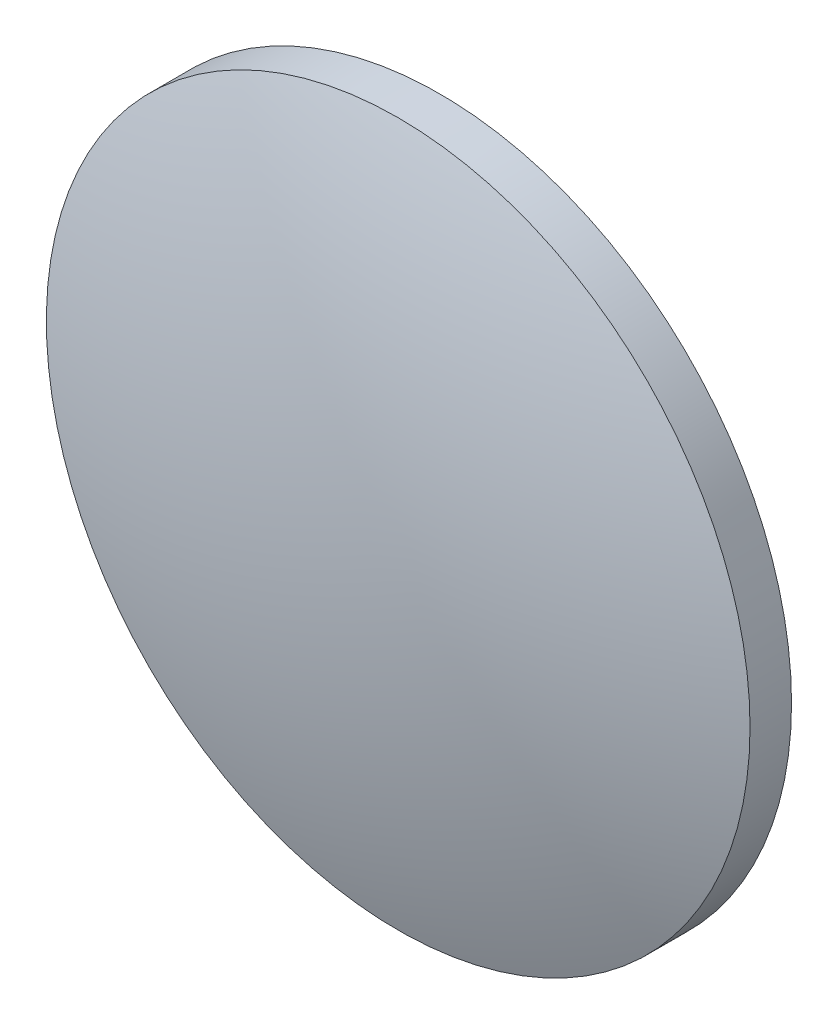
ISO-10303-21;
HEADER;
FILE_DESCRIPTION(('STEP AP214'),'2;1');
FILE_NAME('part.step','',(''),(''),'','','');
FILE_SCHEMA(('AUTOMOTIVE_DESIGN { 1 0 10303 214 1 1 1 1 }'));
ENDSEC;
DATA;
#1=APPLICATION_CONTEXT('core data for automotive mechanical design processes');
#2=APPLICATION_PROTOCOL_DEFINITION('international standard','automotive_design',2000,#1);
#3=PRODUCT_CONTEXT('',#1,'mechanical');
#4=PRODUCT('Part','Part','',(#3));
#5=PRODUCT_RELATED_PRODUCT_CATEGORY('part','',(#4));
#6=PRODUCT_DEFINITION_FORMATION('','',#4);
#7=PRODUCT_DEFINITION_CONTEXT('part definition',#1,'design');
#8=PRODUCT_DEFINITION('design','',#6,#7);
#9=PRODUCT_DEFINITION_SHAPE('','',#8);
#10=(LENGTH_UNIT() NAMED_UNIT(*) SI_UNIT(.MILLI.,.METRE.));
#11=(NAMED_UNIT(*) PLANE_ANGLE_UNIT() SI_UNIT($,.RADIAN.));
#12=(NAMED_UNIT(*) SI_UNIT($,.STERADIAN.) SOLID_ANGLE_UNIT());
#13=UNCERTAINTY_MEASURE_WITH_UNIT(LENGTH_MEASURE(1.E-05),#10,'distance_accuracy_value','');
#14=(GEOMETRIC_REPRESENTATION_CONTEXT(3) GLOBAL_UNCERTAINTY_ASSIGNED_CONTEXT((#13)) GLOBAL_UNIT_ASSIGNED_CONTEXT((#10,
#11,#12)) REPRESENTATION_CONTEXT('',''));
#15=CARTESIAN_POINT('',(0.,0.,0.));
#16=DIRECTION('',(0.,0.,1.));
#17=DIRECTION('',(1.,0.,0.));
#18=AXIS2_PLACEMENT_3D('',#15,#16,#17);
#19=CARTESIAN_POINT('',(0.,0.,-73.615));
#20=DIRECTION('',(0.,0.,1.));
#21=DIRECTION('',(0.,1.,0.));
#22=AXIS2_PLACEMENT_3D('',#19,#20,#21);
#23=SPHERICAL_SURFACE('',#22,77.26);
#24=CARTESIAN_POINT('',(0.,0.,-0.649613685666001));
#25=DIRECTION('',(0.,0.,1.));
#26=DIRECTION('',(1.,0.,0.));
#27=AXIS2_PLACEMENT_3D('',#24,#25,#26);
#28=CIRCLE('',#27,25.4);
#29=CARTESIAN_POINT('',(25.4,0.,-0.649613685666001));
#30=VERTEX_POINT('',#29);
#31=EDGE_CURVE('E8',#30,#30,#28,.T.);
#32=ORIENTED_EDGE('',*,*,#31,.T.);
#33=EDGE_LOOP('',(#32));
#34=FACE_BOUND('',#33,.T.);
#35=ADVANCED_FACE('F12',(#34),#23,.T.);
#36=CARTESIAN_POINT('',(0.,0.,4.30813204540037));
#37=DIRECTION('',(0.,0.,1.));
#38=DIRECTION('',(1.,0.,0.));
#39=AXIS2_PLACEMENT_3D('',#36,#37,#38);
#40=CYLINDRICAL_SURFACE('',#39,25.4);
#41=ORIENTED_EDGE('',*,*,#31,.F.);
#42=EDGE_LOOP('',(#41));
#43=FACE_BOUND('',#42,.T.);
#44=CARTESIAN_POINT('',(0.,0.,-3.645));
#45=DIRECTION('',(0.,0.,1.));
#46=DIRECTION('',(1.,0.,0.));
#47=AXIS2_PLACEMENT_3D('',#44,#45,#46);
#48=CIRCLE('',#47,25.4);
#49=CARTESIAN_POINT('',(25.4,0.,-3.645));
#50=VERTEX_POINT('',#49);
#51=EDGE_CURVE('E18',#50,#50,#48,.T.);
#52=ORIENTED_EDGE('',*,*,#51,.T.);
#53=EDGE_LOOP('',(#52));
#54=FACE_BOUND('',#53,.T.);
#55=ADVANCED_FACE('F24',(#43,#54),#40,.T.);
#56=CARTESIAN_POINT('',(0.,0.,-3.645));
#57=DIRECTION('',(0.,0.,1.));
#58=DIRECTION('',(1.,0.,0.));
#59=AXIS2_PLACEMENT_3D('',#56,#57,#58);
#60=PLANE('',#59);
#61=ORIENTED_EDGE('',*,*,#51,.F.);
#62=EDGE_LOOP('',(#61));
#63=FACE_BOUND('',#62,.T.);
#64=ADVANCED_FACE('F26',(#63),#60,.F.);
#65=CLOSED_SHELL('',(#35,#55,#64));
#66=MANIFOLD_SOLID_BREP('B1',#65);
#67=ADVANCED_BREP_SHAPE_REPRESENTATION('',(#18,#66),#14);
#68=SHAPE_DEFINITION_REPRESENTATION(#9,#67);
ENDSEC;
END-ISO-10303-21;
